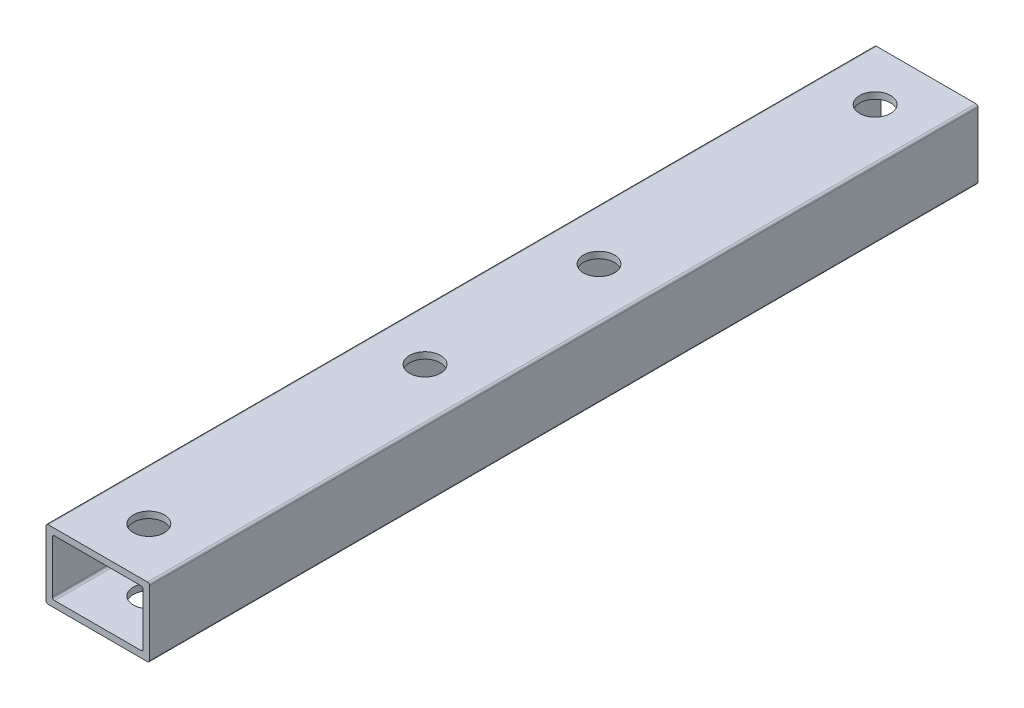
ISO-10303-21;
HEADER;
FILE_DESCRIPTION(('STEP AP214'),'2;1');
FILE_NAME('part.step','',(''),(''),'','','');
FILE_SCHEMA(('AUTOMOTIVE_DESIGN { 1 0 10303 214 1 1 1 1 }'));
ENDSEC;
DATA;
#1=APPLICATION_CONTEXT('core data for automotive mechanical design processes');
#2=APPLICATION_PROTOCOL_DEFINITION('international standard','automotive_design',2000,#1);
#3=PRODUCT_CONTEXT('',#1,'mechanical');
#4=PRODUCT('Part','Part','',(#3));
#5=PRODUCT_RELATED_PRODUCT_CATEGORY('part','',(#4));
#6=PRODUCT_DEFINITION_FORMATION('','',#4);
#7=PRODUCT_DEFINITION_CONTEXT('part definition',#1,'design');
#8=PRODUCT_DEFINITION('design','',#6,#7);
#9=PRODUCT_DEFINITION_SHAPE('','',#8);
#10=(LENGTH_UNIT() NAMED_UNIT(*) SI_UNIT(.MILLI.,.METRE.));
#11=(NAMED_UNIT(*) PLANE_ANGLE_UNIT() SI_UNIT($,.RADIAN.));
#12=(NAMED_UNIT(*) SI_UNIT($,.STERADIAN.) SOLID_ANGLE_UNIT());
#13=UNCERTAINTY_MEASURE_WITH_UNIT(LENGTH_MEASURE(1.E-05),#10,'distance_accuracy_value','');
#14=(GEOMETRIC_REPRESENTATION_CONTEXT(3) GLOBAL_UNCERTAINTY_ASSIGNED_CONTEXT((#13)) GLOBAL_UNIT_ASSIGNED_CONTEXT((#10,
#11,#12)) REPRESENTATION_CONTEXT('',''));
#15=CARTESIAN_POINT('',(0.,0.,0.));
#16=DIRECTION('',(0.,0.,1.));
#17=DIRECTION('',(1.,0.,0.));
#18=AXIS2_PLACEMENT_3D('',#15,#16,#17);
#19=CARTESIAN_POINT('',(-9.14400000000002,-5.969,152.4));
#20=DIRECTION('',(0.,0.,-1.));
#21=DIRECTION('',(-1.,0.,0.));
#22=AXIS2_PLACEMENT_3D('',#19,#20,#21);
#23=CYLINDRICAL_SURFACE('',#22,0.380999999999999);
#24=CARTESIAN_POINT('',(-9.14400000000002,-5.969,152.4));
#25=DIRECTION('',(0.,0.,-1.));
#26=DIRECTION('',(-1.,0.,0.));
#27=AXIS2_PLACEMENT_3D('',#24,#25,#26);
#28=CIRCLE('',#27,0.380999999999999);
#29=CARTESIAN_POINT('',(-9.14400000000002,-6.35000000000001,152.4));
#30=VERTEX_POINT('',#29);
#31=CARTESIAN_POINT('',(-9.52500000000002,-5.969,152.4));
#32=VERTEX_POINT('',#31);
#33=EDGE_CURVE('E131',#30,#32,#28,.T.);
#34=ORIENTED_EDGE('',*,*,#33,.T.);
#35=DIRECTION('',(0.,0.,-1.));
#36=VECTOR('',#35,1.);
#37=CARTESIAN_POINT('',(-9.52500000000002,-5.969,152.4));
#38=LINE('',#37,#36);
#39=CARTESIAN_POINT('',(-9.52500000000002,-5.969,0.));
#40=VERTEX_POINT('',#39);
#41=EDGE_CURVE('E129',#32,#40,#38,.T.);
#42=ORIENTED_EDGE('',*,*,#41,.T.);
#43=CARTESIAN_POINT('',(-9.14400000000002,-5.969,0.));
#44=DIRECTION('',(0.,0.,-1.));
#45=DIRECTION('',(-1.,0.,0.));
#46=AXIS2_PLACEMENT_3D('',#43,#44,#45);
#47=CIRCLE('',#46,0.380999999999999);
#48=CARTESIAN_POINT('',(-9.14400000000002,-6.35000000000001,0.));
#49=VERTEX_POINT('',#48);
#50=EDGE_CURVE('E20',#40,#49,#47,.F.);
#51=ORIENTED_EDGE('',*,*,#50,.T.);
#52=DIRECTION('',(0.,0.,1.));
#53=VECTOR('',#52,1.);
#54=CARTESIAN_POINT('',(-9.14400000000002,-6.35000000000001,152.4));
#55=LINE('',#54,#53);
#56=EDGE_CURVE('E126',#49,#30,#55,.T.);
#57=ORIENTED_EDGE('',*,*,#56,.T.);
#58=EDGE_LOOP('',(#34,#42,#51,#57));
#59=FACE_BOUND('',#58,.T.);
#60=ADVANCED_FACE('F17',(#59),#23,.T.);
#61=CARTESIAN_POINT('',(9.14399999999998,-5.969,152.4));
#62=DIRECTION('',(0.,0.,-1.));
#63=DIRECTION('',(-1.,0.,0.));
#64=AXIS2_PLACEMENT_3D('',#61,#62,#63);
#65=CYLINDRICAL_SURFACE('',#64,0.380999999999999);
#66=CARTESIAN_POINT('',(9.14399999999998,-5.969,152.4));
#67=DIRECTION('',(0.,0.,-1.));
#68=DIRECTION('',(-1.,0.,0.));
#69=AXIS2_PLACEMENT_3D('',#66,#67,#68);
#70=CIRCLE('',#69,0.380999999999999);
#71=CARTESIAN_POINT('',(9.52499999999998,-5.969,152.4));
#72=VERTEX_POINT('',#71);
#73=CARTESIAN_POINT('',(9.14399999999998,-6.35000000000001,152.4));
#74=VERTEX_POINT('',#73);
#75=EDGE_CURVE('E292',#72,#74,#70,.T.);
#76=ORIENTED_EDGE('',*,*,#75,.T.);
#77=DIRECTION('',(0.,0.,1.));
#78=VECTOR('',#77,1.);
#79=CARTESIAN_POINT('',(9.14399999999998,-6.35000000000001,152.4));
#80=LINE('',#79,#78);
#81=CARTESIAN_POINT('',(9.14399999999998,-6.35000000000001,0.));
#82=VERTEX_POINT('',#81);
#83=EDGE_CURVE('E140',#74,#82,#80,.F.);
#84=ORIENTED_EDGE('',*,*,#83,.T.);
#85=CARTESIAN_POINT('',(9.14399999999998,-5.969,0.));
#86=DIRECTION('',(0.,0.,-1.));
#87=DIRECTION('',(-1.,0.,0.));
#88=AXIS2_PLACEMENT_3D('',#85,#86,#87);
#89=CIRCLE('',#88,0.380999999999999);
#90=CARTESIAN_POINT('',(9.52499999999998,-5.969,0.));
#91=VERTEX_POINT('',#90);
#92=EDGE_CURVE('E145',#82,#91,#89,.F.);
#93=ORIENTED_EDGE('',*,*,#92,.T.);
#94=DIRECTION('',(0.,0.,1.));
#95=VECTOR('',#94,1.);
#96=CARTESIAN_POINT('',(9.52499999999998,-5.969,152.4));
#97=LINE('',#96,#95);
#98=EDGE_CURVE('E219',#91,#72,#97,.T.);
#99=ORIENTED_EDGE('',*,*,#98,.T.);
#100=EDGE_LOOP('',(#76,#84,#93,#99));
#101=FACE_BOUND('',#100,.T.);
#102=ADVANCED_FACE('F319',(#101),#65,.T.);
#103=CARTESIAN_POINT('',(0.,-6.35000000000001,143.002));
#104=DIRECTION('',(0.,1.,0.));
#105=DIRECTION('',(0.,0.,1.));
#106=AXIS2_PLACEMENT_3D('',#103,#104,#105);
#107=CYLINDRICAL_SURFACE('',#106,2.85750000000001);
#108=CARTESIAN_POINT('',(0.,-5.1562,143.002));
#109=DIRECTION('',(0.,1.,0.));
#110=DIRECTION('',(0.,0.,1.));
#111=AXIS2_PLACEMENT_3D('',#108,#109,#110);
#112=CIRCLE('',#111,2.85750000000001);
#113=CARTESIAN_POINT('',(0.,-5.1562,145.8595));
#114=VERTEX_POINT('',#113);
#115=EDGE_CURVE('E217',#114,#114,#112,.F.);
#116=ORIENTED_EDGE('',*,*,#115,.F.);
#117=EDGE_LOOP('',(#116));
#118=FACE_BOUND('',#117,.T.);
#119=CARTESIAN_POINT('',(0.,-6.35000000000001,143.002));
#120=DIRECTION('',(0.,1.,0.));
#121=DIRECTION('',(0.,0.,1.));
#122=AXIS2_PLACEMENT_3D('',#119,#120,#121);
#123=CIRCLE('',#122,2.85750000000001);
#124=CARTESIAN_POINT('',(0.,-6.35000000000001,145.8595));
#125=VERTEX_POINT('',#124);
#126=EDGE_CURVE('E222',#125,#125,#123,.F.);
#127=ORIENTED_EDGE('',*,*,#126,.T.);
#128=EDGE_LOOP('',(#127));
#129=FACE_BOUND('',#128,.T.);
#130=ADVANCED_FACE('F321',(#118,#129),#107,.F.);
#131=CARTESIAN_POINT('',(0.,-6.35000000000001,92.202));
#132=DIRECTION('',(0.,1.,0.));
#133=DIRECTION('',(0.,0.,1.));
#134=AXIS2_PLACEMENT_3D('',#131,#132,#133);
#135=CYLINDRICAL_SURFACE('',#134,2.8575);
#136=CARTESIAN_POINT('',(0.,-5.1562,92.202));
#137=DIRECTION('',(0.,1.,0.));
#138=DIRECTION('',(0.,0.,1.));
#139=AXIS2_PLACEMENT_3D('',#136,#137,#138);
#140=CIRCLE('',#139,2.8575);
#141=CARTESIAN_POINT('',(0.,-5.1562,95.0595));
#142=VERTEX_POINT('',#141);
#143=EDGE_CURVE('E262',#142,#142,#140,.F.);
#144=ORIENTED_EDGE('',*,*,#143,.F.);
#145=EDGE_LOOP('',(#144));
#146=FACE_BOUND('',#145,.T.);
#147=CARTESIAN_POINT('',(0.,-6.35000000000001,92.202));
#148=DIRECTION('',(0.,1.,0.));
#149=DIRECTION('',(0.,0.,1.));
#150=AXIS2_PLACEMENT_3D('',#147,#148,#149);
#151=CIRCLE('',#150,2.8575);
#152=CARTESIAN_POINT('',(0.,-6.35000000000001,95.0595));
#153=VERTEX_POINT('',#152);
#154=EDGE_CURVE('E272',#153,#153,#151,.F.);
#155=ORIENTED_EDGE('',*,*,#154,.T.);
#156=EDGE_LOOP('',(#155));
#157=FACE_BOUND('',#156,.T.);
#158=ADVANCED_FACE('F327',(#146,#157),#135,.F.);
#159=CARTESIAN_POINT('',(0.,-6.35000000000001,60.198));
#160=DIRECTION('',(0.,1.,0.));
#161=DIRECTION('',(0.,0.,1.));
#162=AXIS2_PLACEMENT_3D('',#159,#160,#161);
#163=CYLINDRICAL_SURFACE('',#162,2.8575);
#164=CARTESIAN_POINT('',(0.,-5.1562,60.198));
#165=DIRECTION('',(0.,1.,0.));
#166=DIRECTION('',(0.,0.,1.));
#167=AXIS2_PLACEMENT_3D('',#164,#165,#166);
#168=CIRCLE('',#167,2.8575);
#169=CARTESIAN_POINT('',(0.,-5.1562,63.0555));
#170=VERTEX_POINT('',#169);
#171=EDGE_CURVE('E259',#170,#170,#168,.F.);
#172=ORIENTED_EDGE('',*,*,#171,.F.);
#173=EDGE_LOOP('',(#172));
#174=FACE_BOUND('',#173,.T.);
#175=CARTESIAN_POINT('',(0.,-6.35000000000001,60.198));
#176=DIRECTION('',(0.,1.,0.));
#177=DIRECTION('',(0.,0.,1.));
#178=AXIS2_PLACEMENT_3D('',#175,#176,#177);
#179=CIRCLE('',#178,2.8575);
#180=CARTESIAN_POINT('',(0.,-6.35000000000001,63.0555));
#181=VERTEX_POINT('',#180);
#182=EDGE_CURVE('E269',#181,#181,#179,.F.);
#183=ORIENTED_EDGE('',*,*,#182,.T.);
#184=EDGE_LOOP('',(#183));
#185=FACE_BOUND('',#184,.T.);
#186=ADVANCED_FACE('F402',(#174,#185),#163,.F.);
#187=CARTESIAN_POINT('',(0.,-6.35000000000001,9.398));
#188=DIRECTION('',(0.,1.,0.));
#189=DIRECTION('',(0.,0.,1.));
#190=AXIS2_PLACEMENT_3D('',#187,#188,#189);
#191=CYLINDRICAL_SURFACE('',#190,2.8575);
#192=CARTESIAN_POINT('',(0.,-5.1562,9.398));
#193=DIRECTION('',(0.,1.,0.));
#194=DIRECTION('',(0.,0.,1.));
#195=AXIS2_PLACEMENT_3D('',#192,#193,#194);
#196=CIRCLE('',#195,2.8575);
#197=CARTESIAN_POINT('',(0.,-5.1562,12.2555));
#198=VERTEX_POINT('',#197);
#199=EDGE_CURVE('E208',#198,#198,#196,.F.);
#200=ORIENTED_EDGE('',*,*,#199,.F.);
#201=EDGE_LOOP('',(#200));
#202=FACE_BOUND('',#201,.T.);
#203=CARTESIAN_POINT('',(0.,-6.35000000000001,9.398));
#204=DIRECTION('',(0.,1.,0.));
#205=DIRECTION('',(0.,0.,1.));
#206=AXIS2_PLACEMENT_3D('',#203,#204,#205);
#207=CIRCLE('',#206,2.8575);
#208=CARTESIAN_POINT('',(0.,-6.35000000000001,12.2555));
#209=VERTEX_POINT('',#208);
#210=EDGE_CURVE('E141',#209,#209,#207,.F.);
#211=ORIENTED_EDGE('',*,*,#210,.T.);
#212=EDGE_LOOP('',(#211));
#213=FACE_BOUND('',#212,.T.);
#214=ADVANCED_FACE('F398',(#202,#213),#191,.F.);
#215=CARTESIAN_POINT('',(-7.95020000000002,-4.7752,152.4));
#216=DIRECTION('',(0.,0.,-1.));
#217=DIRECTION('',(-1.,0.,0.));
#218=AXIS2_PLACEMENT_3D('',#215,#216,#217);
#219=CYLINDRICAL_SURFACE('',#218,0.380999999999999);
#220=DIRECTION('',(0.,0.,-1.));
#221=VECTOR('',#220,1.);
#222=CARTESIAN_POINT('',(-8.33120000000002,-4.7752,152.4));
#223=LINE('',#222,#221);
#224=CARTESIAN_POINT('',(-8.33120000000002,-4.7752,152.4));
#225=VERTEX_POINT('',#224);
#226=CARTESIAN_POINT('',(-8.33120000000002,-4.7752,0.));
#227=VERTEX_POINT('',#226);
#228=EDGE_CURVE('E214',#225,#227,#223,.T.);
#229=ORIENTED_EDGE('',*,*,#228,.F.);
#230=CARTESIAN_POINT('',(-7.95020000000002,-4.7752,152.4));
#231=DIRECTION('',(0.,0.,-1.));
#232=DIRECTION('',(-1.,0.,0.));
#233=AXIS2_PLACEMENT_3D('',#230,#231,#232);
#234=CIRCLE('',#233,0.380999999999999);
#235=CARTESIAN_POINT('',(-7.95020000000002,-5.1562,152.4));
#236=VERTEX_POINT('',#235);
#237=EDGE_CURVE('E290',#236,#225,#234,.T.);
#238=ORIENTED_EDGE('',*,*,#237,.F.);
#239=DIRECTION('',(0.,0.,1.));
#240=VECTOR('',#239,1.);
#241=CARTESIAN_POINT('',(-7.95020000000002,-5.1562,152.4));
#242=LINE('',#241,#240);
#243=CARTESIAN_POINT('',(-7.95020000000002,-5.1562,0.));
#244=VERTEX_POINT('',#243);
#245=EDGE_CURVE('E205',#244,#236,#242,.T.);
#246=ORIENTED_EDGE('',*,*,#245,.F.);
#247=CARTESIAN_POINT('',(-7.95020000000002,-4.7752,0.));
#248=DIRECTION('',(0.,0.,-1.));
#249=DIRECTION('',(-1.,0.,0.));
#250=AXIS2_PLACEMENT_3D('',#247,#248,#249);
#251=CIRCLE('',#250,0.380999999999999);
#252=EDGE_CURVE('E288',#227,#244,#251,.F.);
#253=ORIENTED_EDGE('',*,*,#252,.F.);
#254=EDGE_LOOP('',(#229,#238,#246,#253));
#255=FACE_BOUND('',#254,.T.);
#256=ADVANCED_FACE('F394',(#255),#219,.F.);
#257=CARTESIAN_POINT('',(7.95019999999998,-4.7752,152.4));
#258=DIRECTION('',(0.,0.,-1.));
#259=DIRECTION('',(-1.,0.,0.));
#260=AXIS2_PLACEMENT_3D('',#257,#258,#259);
#261=CYLINDRICAL_SURFACE('',#260,0.380999999999999);
#262=DIRECTION('',(0.,0.,1.));
#263=VECTOR('',#262,1.);
#264=CARTESIAN_POINT('',(7.95019999999997,-5.1562,152.4));
#265=LINE('',#264,#263);
#266=CARTESIAN_POINT('',(7.95019999999997,-5.1562,152.4));
#267=VERTEX_POINT('',#266);
#268=CARTESIAN_POINT('',(7.95019999999997,-5.1562,0.));
#269=VERTEX_POINT('',#268);
#270=EDGE_CURVE('E202',#267,#269,#265,.F.);
#271=ORIENTED_EDGE('',*,*,#270,.F.);
#272=CARTESIAN_POINT('',(7.95019999999998,-4.7752,152.4));
#273=DIRECTION('',(0.,0.,-1.));
#274=DIRECTION('',(-1.,0.,0.));
#275=AXIS2_PLACEMENT_3D('',#272,#273,#274);
#276=CIRCLE('',#275,0.380999999999999);
#277=CARTESIAN_POINT('',(8.33119999999998,-4.7752,152.4));
#278=VERTEX_POINT('',#277);
#279=EDGE_CURVE('E286',#278,#267,#276,.T.);
#280=ORIENTED_EDGE('',*,*,#279,.F.);
#281=DIRECTION('',(0.,0.,1.));
#282=VECTOR('',#281,1.);
#283=CARTESIAN_POINT('',(8.33119999999998,-4.7752,152.4));
#284=LINE('',#283,#282);
#285=CARTESIAN_POINT('',(8.33119999999998,-4.7752,0.));
#286=VERTEX_POINT('',#285);
#287=EDGE_CURVE('E199',#286,#278,#284,.T.);
#288=ORIENTED_EDGE('',*,*,#287,.F.);
#289=CARTESIAN_POINT('',(7.95019999999998,-4.7752,0.));
#290=DIRECTION('',(0.,0.,-1.));
#291=DIRECTION('',(-1.,0.,0.));
#292=AXIS2_PLACEMENT_3D('',#289,#290,#291);
#293=CIRCLE('',#292,0.380999999999999);
#294=EDGE_CURVE('E284',#269,#286,#293,.F.);
#295=ORIENTED_EDGE('',*,*,#294,.F.);
#296=EDGE_LOOP('',(#271,#280,#288,#295));
#297=FACE_BOUND('',#296,.T.);
#298=ADVANCED_FACE('F390',(#297),#261,.F.);
#299=CARTESIAN_POINT('',(7.95019999999998,4.77519999999999,152.4));
#300=DIRECTION('',(0.,0.,-1.));
#301=DIRECTION('',(-1.,0.,0.));
#302=AXIS2_PLACEMENT_3D('',#299,#300,#301);
#303=CYLINDRICAL_SURFACE('',#302,0.380999999999999);
#304=DIRECTION('',(0.,0.,1.));
#305=VECTOR('',#304,1.);
#306=CARTESIAN_POINT('',(8.33119999999998,4.77519999999999,152.4));
#307=LINE('',#306,#305);
#308=CARTESIAN_POINT('',(8.33119999999998,4.77519999999999,152.4));
#309=VERTEX_POINT('',#308);
#310=CARTESIAN_POINT('',(8.33119999999998,4.77519999999999,0.));
#311=VERTEX_POINT('',#310);
#312=EDGE_CURVE('E195',#309,#311,#307,.F.);
#313=ORIENTED_EDGE('',*,*,#312,.F.);
#314=CARTESIAN_POINT('',(7.95019999999998,4.77519999999999,152.4));
#315=DIRECTION('',(0.,0.,-1.));
#316=DIRECTION('',(-1.,0.,0.));
#317=AXIS2_PLACEMENT_3D('',#314,#315,#316);
#318=CIRCLE('',#317,0.380999999999999);
#319=CARTESIAN_POINT('',(7.95019999999998,5.15619999999999,152.4));
#320=VERTEX_POINT('',#319);
#321=EDGE_CURVE('E282',#320,#309,#318,.T.);
#322=ORIENTED_EDGE('',*,*,#321,.F.);
#323=DIRECTION('',(0.,0.,-1.));
#324=VECTOR('',#323,1.);
#325=CARTESIAN_POINT('',(7.95019999999997,5.15619999999999,152.4));
#326=LINE('',#325,#324);
#327=CARTESIAN_POINT('',(7.95019999999998,5.15619999999999,0.));
#328=VERTEX_POINT('',#327);
#329=EDGE_CURVE('E191',#328,#320,#326,.F.);
#330=ORIENTED_EDGE('',*,*,#329,.F.);
#331=CARTESIAN_POINT('',(7.95019999999998,4.77519999999999,0.));
#332=DIRECTION('',(0.,0.,-1.));
#333=DIRECTION('',(-1.,0.,0.));
#334=AXIS2_PLACEMENT_3D('',#331,#332,#333);
#335=CIRCLE('',#334,0.380999999999999);
#336=EDGE_CURVE('E280',#311,#328,#335,.F.);
#337=ORIENTED_EDGE('',*,*,#336,.F.);
#338=EDGE_LOOP('',(#313,#322,#330,#337));
#339=FACE_BOUND('',#338,.T.);
#340=ADVANCED_FACE('F386',(#339),#303,.F.);
#341=CARTESIAN_POINT('',(-7.95020000000002,4.77519999999999,152.4));
#342=DIRECTION('',(0.,0.,-1.));
#343=DIRECTION('',(-1.,0.,0.));
#344=AXIS2_PLACEMENT_3D('',#341,#342,#343);
#345=CYLINDRICAL_SURFACE('',#344,0.380999999999999);
#346=DIRECTION('',(0.,0.,-1.));
#347=VECTOR('',#346,1.);
#348=CARTESIAN_POINT('',(-7.95020000000002,5.15619999999999,152.4));
#349=LINE('',#348,#347);
#350=CARTESIAN_POINT('',(-7.95020000000002,5.15619999999999,152.4));
#351=VERTEX_POINT('',#350);
#352=CARTESIAN_POINT('',(-7.95020000000002,5.15619999999999,0.));
#353=VERTEX_POINT('',#352);
#354=EDGE_CURVE('E194',#351,#353,#349,.T.);
#355=ORIENTED_EDGE('',*,*,#354,.F.);
#356=CARTESIAN_POINT('',(-7.95020000000002,4.77519999999999,152.4));
#357=DIRECTION('',(0.,0.,-1.));
#358=DIRECTION('',(-1.,0.,0.));
#359=AXIS2_PLACEMENT_3D('',#356,#357,#358);
#360=CIRCLE('',#359,0.380999999999999);
#361=CARTESIAN_POINT('',(-8.33120000000002,4.77519999999999,152.4));
#362=VERTEX_POINT('',#361);
#363=EDGE_CURVE('E278',#362,#351,#360,.T.);
#364=ORIENTED_EDGE('',*,*,#363,.F.);
#365=DIRECTION('',(0.,0.,-1.));
#366=VECTOR('',#365,1.);
#367=CARTESIAN_POINT('',(-8.33120000000002,4.77519999999999,152.4));
#368=LINE('',#367,#366);
#369=CARTESIAN_POINT('',(-8.33120000000002,4.77519999999999,0.));
#370=VERTEX_POINT('',#369);
#371=EDGE_CURVE('E211',#370,#362,#368,.F.);
#372=ORIENTED_EDGE('',*,*,#371,.F.);
#373=CARTESIAN_POINT('',(-7.95020000000002,4.77519999999999,0.));
#374=DIRECTION('',(0.,0.,-1.));
#375=DIRECTION('',(-1.,0.,0.));
#376=AXIS2_PLACEMENT_3D('',#373,#374,#375);
#377=CIRCLE('',#376,0.380999999999999);
#378=EDGE_CURVE('E228',#353,#370,#377,.F.);
#379=ORIENTED_EDGE('',*,*,#378,.F.);
#380=EDGE_LOOP('',(#355,#364,#372,#379));
#381=FACE_BOUND('',#380,.T.);
#382=ADVANCED_FACE('F383',(#381),#345,.F.);
#383=CARTESIAN_POINT('',(-9.52500000000002,-5.969,152.4));
#384=DIRECTION('',(1.,0.,0.));
#385=DIRECTION('',(0.,0.,-1.));
#386=AXIS2_PLACEMENT_3D('',#383,#384,#385);
#387=PLANE('',#386);
#388=ORIENTED_EDGE('',*,*,#41,.F.);
#389=DIRECTION('',(0.,1.,0.));
#390=VECTOR('',#389,1.);
#391=CARTESIAN_POINT('',(-9.52500000000002,-5.969,152.4));
#392=LINE('',#391,#390);
#393=CARTESIAN_POINT('',(-9.52500000000002,5.96899999999999,152.4));
#394=VERTEX_POINT('',#393);
#395=EDGE_CURVE('E187',#32,#394,#392,.T.);
#396=ORIENTED_EDGE('',*,*,#395,.T.);
#397=DIRECTION('',(0.,0.,-1.));
#398=VECTOR('',#397,1.);
#399=CARTESIAN_POINT('',(-9.52500000000002,5.96899999999999,152.4));
#400=LINE('',#399,#398);
#401=CARTESIAN_POINT('',(-9.52500000000002,5.96899999999999,0.));
#402=VERTEX_POINT('',#401);
#403=EDGE_CURVE('E172',#402,#394,#400,.F.);
#404=ORIENTED_EDGE('',*,*,#403,.F.);
#405=DIRECTION('',(0.,1.,0.));
#406=VECTOR('',#405,1.);
#407=CARTESIAN_POINT('',(-9.52500000000002,-5.969,0.));
#408=LINE('',#407,#406);
#409=EDGE_CURVE('E157',#40,#402,#408,.T.);
#410=ORIENTED_EDGE('',*,*,#409,.F.);
#411=EDGE_LOOP('',(#388,#396,#404,#410));
#412=FACE_BOUND('',#411,.T.);
#413=ADVANCED_FACE('F297',(#412),#387,.F.);
#414=CARTESIAN_POINT('',(9.52499999999998,-5.969,152.4));
#415=DIRECTION('',(-1.,0.,0.));
#416=DIRECTION('',(0.,0.,1.));
#417=AXIS2_PLACEMENT_3D('',#414,#415,#416);
#418=PLANE('',#417);
#419=DIRECTION('',(0.,0.,-1.));
#420=VECTOR('',#419,1.);
#421=CARTESIAN_POINT('',(9.52499999999998,5.96899999999999,152.4));
#422=LINE('',#421,#420);
#423=CARTESIAN_POINT('',(9.52499999999998,5.96899999999999,152.4));
#424=VERTEX_POINT('',#423);
#425=CARTESIAN_POINT('',(9.52499999999998,5.96899999999999,0.));
#426=VERTEX_POINT('',#425);
#427=EDGE_CURVE('E190',#424,#426,#422,.T.);
#428=ORIENTED_EDGE('',*,*,#427,.F.);
#429=DIRECTION('',(0.,1.,0.));
#430=VECTOR('',#429,1.);
#431=CARTESIAN_POINT('',(9.52499999999998,-5.969,152.4));
#432=LINE('',#431,#430);
#433=EDGE_CURVE('E183',#424,#72,#432,.F.);
#434=ORIENTED_EDGE('',*,*,#433,.T.);
#435=ORIENTED_EDGE('',*,*,#98,.F.);
#436=DIRECTION('',(0.,1.,0.));
#437=VECTOR('',#436,1.);
#438=CARTESIAN_POINT('',(9.52499999999998,-5.969,0.));
#439=LINE('',#438,#437);
#440=EDGE_CURVE('E148',#426,#91,#439,.F.);
#441=ORIENTED_EDGE('',*,*,#440,.F.);
#442=EDGE_LOOP('',(#428,#434,#435,#441));
#443=FACE_BOUND('',#442,.T.);
#444=ADVANCED_FACE('F316',(#443),#418,.F.);
#445=CARTESIAN_POINT('',(-9.14400000000002,-6.35000000000001,152.4));
#446=DIRECTION('',(0.,1.,0.));
#447=DIRECTION('',(0.,0.,1.));
#448=AXIS2_PLACEMENT_3D('',#445,#446,#447);
#449=PLANE('',#448);
#450=ORIENTED_EDGE('',*,*,#83,.F.);
#451=DIRECTION('',(-1.,0.,0.));
#452=VECTOR('',#451,1.);
#453=CARTESIAN_POINT('',(-9.14400000000002,-6.35000000000001,152.4));
#454=LINE('',#453,#452);
#455=EDGE_CURVE('E139',#74,#30,#454,.T.);
#456=ORIENTED_EDGE('',*,*,#455,.T.);
#457=ORIENTED_EDGE('',*,*,#56,.F.);
#458=DIRECTION('',(-1.,0.,0.));
#459=VECTOR('',#458,1.);
#460=CARTESIAN_POINT('',(-9.14400000000002,-6.35000000000001,0.));
#461=LINE('',#460,#459);
#462=EDGE_CURVE('E137',#82,#49,#461,.T.);
#463=ORIENTED_EDGE('',*,*,#462,.F.);
#464=EDGE_LOOP('',(#450,#456,#457,#463));
#465=FACE_BOUND('',#464,.T.);
#466=ORIENTED_EDGE('',*,*,#210,.F.);
#467=EDGE_LOOP('',(#466));
#468=FACE_BOUND('',#467,.T.);
#469=ORIENTED_EDGE('',*,*,#182,.F.);
#470=EDGE_LOOP('',(#469));
#471=FACE_BOUND('',#470,.T.);
#472=ORIENTED_EDGE('',*,*,#154,.F.);
#473=EDGE_LOOP('',(#472));
#474=FACE_BOUND('',#473,.T.);
#475=ORIENTED_EDGE('',*,*,#126,.F.);
#476=EDGE_LOOP('',(#475));
#477=FACE_BOUND('',#476,.T.);
#478=ADVANCED_FACE('F135',(#465,#468,#471,#474,#477),#449,.F.);
#479=CARTESIAN_POINT('',(-8.33120000000002,-4.7752,152.4));
#480=DIRECTION('',(1.,0.,0.));
#481=DIRECTION('',(0.,0.,-1.));
#482=AXIS2_PLACEMENT_3D('',#479,#480,#481);
#483=PLANE('',#482);
#484=DIRECTION('',(0.,1.,0.));
#485=VECTOR('',#484,1.);
#486=CARTESIAN_POINT('',(-8.33120000000002,-5.969,152.4));
#487=LINE('',#486,#485);
#488=EDGE_CURVE('E169',#362,#225,#487,.F.);
#489=ORIENTED_EDGE('',*,*,#488,.T.);
#490=ORIENTED_EDGE('',*,*,#228,.T.);
#491=DIRECTION('',(0.,1.,0.));
#492=VECTOR('',#491,1.);
#493=CARTESIAN_POINT('',(-8.33120000000002,-5.969,0.));
#494=LINE('',#493,#492);
#495=EDGE_CURVE('E147',#370,#227,#494,.F.);
#496=ORIENTED_EDGE('',*,*,#495,.F.);
#497=ORIENTED_EDGE('',*,*,#371,.T.);
#498=EDGE_LOOP('',(#489,#490,#496,#497));
#499=FACE_BOUND('',#498,.T.);
#500=ADVANCED_FACE('F372',(#499),#483,.T.);
#501=CARTESIAN_POINT('',(-7.95020000000002,-5.1562,152.4));
#502=DIRECTION('',(0.,1.,0.));
#503=DIRECTION('',(0.,0.,1.));
#504=AXIS2_PLACEMENT_3D('',#501,#502,#503);
#505=PLANE('',#504);
#506=DIRECTION('',(-1.,0.,0.));
#507=VECTOR('',#506,1.);
#508=CARTESIAN_POINT('',(-9.14400000000002,-5.1562,152.4));
#509=LINE('',#508,#507);
#510=EDGE_CURVE('E179',#236,#267,#509,.F.);
#511=ORIENTED_EDGE('',*,*,#510,.T.);
#512=ORIENTED_EDGE('',*,*,#270,.T.);
#513=DIRECTION('',(-1.,0.,0.));
#514=VECTOR('',#513,1.);
#515=CARTESIAN_POINT('',(-9.14400000000002,-5.1562,0.));
#516=LINE('',#515,#514);
#517=EDGE_CURVE('E151',#244,#269,#516,.F.);
#518=ORIENTED_EDGE('',*,*,#517,.F.);
#519=ORIENTED_EDGE('',*,*,#245,.T.);
#520=EDGE_LOOP('',(#511,#512,#518,#519));
#521=FACE_BOUND('',#520,.T.);
#522=ORIENTED_EDGE('',*,*,#199,.T.);
#523=EDGE_LOOP('',(#522));
#524=FACE_BOUND('',#523,.T.);
#525=ORIENTED_EDGE('',*,*,#171,.T.);
#526=EDGE_LOOP('',(#525));
#527=FACE_BOUND('',#526,.T.);
#528=ORIENTED_EDGE('',*,*,#143,.T.);
#529=EDGE_LOOP('',(#528));
#530=FACE_BOUND('',#529,.T.);
#531=ORIENTED_EDGE('',*,*,#115,.T.);
#532=EDGE_LOOP('',(#531));
#533=FACE_BOUND('',#532,.T.);
#534=ADVANCED_FACE('F368',(#521,#524,#527,#530,#533),#505,.T.);
#535=CARTESIAN_POINT('',(8.33119999999998,-4.7752,152.4));
#536=DIRECTION('',(-1.,0.,0.));
#537=DIRECTION('',(0.,-1.,0.));
#538=AXIS2_PLACEMENT_3D('',#535,#536,#537);
#539=PLANE('',#538);
#540=DIRECTION('',(0.,1.,0.));
#541=VECTOR('',#540,1.);
#542=CARTESIAN_POINT('',(8.33119999999998,-5.969,152.4));
#543=LINE('',#542,#541);
#544=EDGE_CURVE('E176',#278,#309,#543,.T.);
#545=ORIENTED_EDGE('',*,*,#544,.T.);
#546=ORIENTED_EDGE('',*,*,#312,.T.);
#547=DIRECTION('',(0.,1.,0.));
#548=VECTOR('',#547,1.);
#549=CARTESIAN_POINT('',(8.33119999999998,-5.969,0.));
#550=LINE('',#549,#548);
#551=EDGE_CURVE('E599',#286,#311,#550,.T.);
#552=ORIENTED_EDGE('',*,*,#551,.F.);
#553=ORIENTED_EDGE('',*,*,#287,.T.);
#554=EDGE_LOOP('',(#545,#546,#552,#553));
#555=FACE_BOUND('',#554,.T.);
#556=ADVANCED_FACE('F364',(#555),#539,.T.);
#557=CARTESIAN_POINT('',(-7.95020000000002,5.15619999999999,152.4));
#558=DIRECTION('',(0.,-1.,0.));
#559=DIRECTION('',(0.,0.,-1.));
#560=AXIS2_PLACEMENT_3D('',#557,#558,#559);
#561=PLANE('',#560);
#562=DIRECTION('',(-1.,0.,0.));
#563=VECTOR('',#562,1.);
#564=CARTESIAN_POINT('',(-9.14400000000002,5.15619999999999,152.4));
#565=LINE('',#564,#563);
#566=EDGE_CURVE('E173',#320,#351,#565,.T.);
#567=ORIENTED_EDGE('',*,*,#566,.T.);
#568=ORIENTED_EDGE('',*,*,#354,.T.);
#569=DIRECTION('',(-1.,0.,0.));
#570=VECTOR('',#569,1.);
#571=CARTESIAN_POINT('',(-9.14400000000002,5.15619999999999,0.));
#572=LINE('',#571,#570);
#573=EDGE_CURVE('E240',#328,#353,#572,.T.);
#574=ORIENTED_EDGE('',*,*,#573,.F.);
#575=ORIENTED_EDGE('',*,*,#329,.T.);
#576=EDGE_LOOP('',(#567,#568,#574,#575));
#577=FACE_BOUND('',#576,.T.);
#578=CARTESIAN_POINT('',(0.,5.1562,9.398));
#579=DIRECTION('',(0.,1.,0.));
#580=DIRECTION('',(0.,0.,1.));
#581=AXIS2_PLACEMENT_3D('',#578,#579,#580);
#582=CIRCLE('',#581,2.8575);
#583=CARTESIAN_POINT('',(0.,5.1562,12.2555));
#584=VERTEX_POINT('',#583);
#585=EDGE_CURVE('E225',#584,#584,#582,.T.);
#586=ORIENTED_EDGE('',*,*,#585,.T.);
#587=EDGE_LOOP('',(#586));
#588=FACE_BOUND('',#587,.T.);
#589=CARTESIAN_POINT('',(0.,5.1562,60.198));
#590=DIRECTION('',(0.,1.,0.));
#591=DIRECTION('',(0.,0.,1.));
#592=AXIS2_PLACEMENT_3D('',#589,#590,#591);
#593=CIRCLE('',#592,2.8575);
#594=CARTESIAN_POINT('',(0.,5.1562,63.0555));
#595=VERTEX_POINT('',#594);
#596=EDGE_CURVE('E249',#595,#595,#593,.T.);
#597=ORIENTED_EDGE('',*,*,#596,.T.);
#598=EDGE_LOOP('',(#597));
#599=FACE_BOUND('',#598,.T.);
#600=CARTESIAN_POINT('',(0.,5.1562,92.202));
#601=DIRECTION('',(0.,1.,0.));
#602=DIRECTION('',(0.,0.,1.));
#603=AXIS2_PLACEMENT_3D('',#600,#601,#602);
#604=CIRCLE('',#603,2.8575);
#605=CARTESIAN_POINT('',(0.,5.1562,95.0595));
#606=VERTEX_POINT('',#605);
#607=EDGE_CURVE('E252',#606,#606,#604,.T.);
#608=ORIENTED_EDGE('',*,*,#607,.T.);
#609=EDGE_LOOP('',(#608));
#610=FACE_BOUND('',#609,.T.);
#611=CARTESIAN_POINT('',(0.,5.1562,143.002));
#612=DIRECTION('',(0.,1.,0.));
#613=DIRECTION('',(0.,0.,1.));
#614=AXIS2_PLACEMENT_3D('',#611,#612,#613);
#615=CIRCLE('',#614,2.85750000000001);
#616=CARTESIAN_POINT('',(0.,5.1562,145.8595));
#617=VERTEX_POINT('',#616);
#618=EDGE_CURVE('E198',#617,#617,#615,.T.);
#619=ORIENTED_EDGE('',*,*,#618,.T.);
#620=EDGE_LOOP('',(#619));
#621=FACE_BOUND('',#620,.T.);
#622=ADVANCED_FACE('F360',(#577,#588,#599,#610,#621),#561,.T.);
#623=CARTESIAN_POINT('',(0.,-6.35000000000001,143.002));
#624=DIRECTION('',(0.,1.,0.));
#625=DIRECTION('',(0.,0.,1.));
#626=AXIS2_PLACEMENT_3D('',#623,#624,#625);
#627=CYLINDRICAL_SURFACE('',#626,2.85750000000001);
#628=ORIENTED_EDGE('',*,*,#618,.F.);
#629=EDGE_LOOP('',(#628));
#630=FACE_BOUND('',#629,.T.);
#631=CARTESIAN_POINT('',(0.,6.34999999999999,143.002));
#632=DIRECTION('',(0.,1.,0.));
#633=DIRECTION('',(0.,0.,1.));
#634=AXIS2_PLACEMENT_3D('',#631,#632,#633);
#635=CIRCLE('',#634,2.85750000000001);
#636=CARTESIAN_POINT('',(0.,6.34999999999999,145.8595));
#637=VERTEX_POINT('',#636);
#638=EDGE_CURVE('E237',#637,#637,#635,.T.);
#639=ORIENTED_EDGE('',*,*,#638,.T.);
#640=EDGE_LOOP('',(#639));
#641=FACE_BOUND('',#640,.T.);
#642=ADVANCED_FACE('F356',(#630,#641),#627,.F.);
#643=CARTESIAN_POINT('',(0.,-6.35000000000001,92.202));
#644=DIRECTION('',(0.,1.,0.));
#645=DIRECTION('',(0.,0.,1.));
#646=AXIS2_PLACEMENT_3D('',#643,#644,#645);
#647=CYLINDRICAL_SURFACE('',#646,2.8575);
#648=ORIENTED_EDGE('',*,*,#607,.F.);
#649=EDGE_LOOP('',(#648));
#650=FACE_BOUND('',#649,.T.);
#651=CARTESIAN_POINT('',(0.,6.34999999999999,92.202));
#652=DIRECTION('',(0.,1.,0.));
#653=DIRECTION('',(0.,0.,1.));
#654=AXIS2_PLACEMENT_3D('',#651,#652,#653);
#655=CIRCLE('',#654,2.8575);
#656=CARTESIAN_POINT('',(0.,6.34999999999999,95.0595));
#657=VERTEX_POINT('',#656);
#658=EDGE_CURVE('E234',#657,#657,#655,.T.);
#659=ORIENTED_EDGE('',*,*,#658,.T.);
#660=EDGE_LOOP('',(#659));
#661=FACE_BOUND('',#660,.T.);
#662=ADVANCED_FACE('F352',(#650,#661),#647,.F.);
#663=CARTESIAN_POINT('',(0.,-6.35000000000001,60.198));
#664=DIRECTION('',(0.,1.,0.));
#665=DIRECTION('',(0.,0.,1.));
#666=AXIS2_PLACEMENT_3D('',#663,#664,#665);
#667=CYLINDRICAL_SURFACE('',#666,2.8575);
#668=ORIENTED_EDGE('',*,*,#596,.F.);
#669=EDGE_LOOP('',(#668));
#670=FACE_BOUND('',#669,.T.);
#671=CARTESIAN_POINT('',(0.,6.34999999999999,60.198));
#672=DIRECTION('',(0.,1.,0.));
#673=DIRECTION('',(0.,0.,1.));
#674=AXIS2_PLACEMENT_3D('',#671,#672,#673);
#675=CIRCLE('',#674,2.8575);
#676=CARTESIAN_POINT('',(0.,6.34999999999999,63.0555));
#677=VERTEX_POINT('',#676);
#678=EDGE_CURVE('E231',#677,#677,#675,.T.);
#679=ORIENTED_EDGE('',*,*,#678,.T.);
#680=EDGE_LOOP('',(#679));
#681=FACE_BOUND('',#680,.T.);
#682=ADVANCED_FACE('F348',(#670,#681),#667,.F.);
#683=CARTESIAN_POINT('',(0.,-6.35000000000001,9.398));
#684=DIRECTION('',(0.,1.,0.));
#685=DIRECTION('',(0.,0.,1.));
#686=AXIS2_PLACEMENT_3D('',#683,#684,#685);
#687=CYLINDRICAL_SURFACE('',#686,2.8575);
#688=ORIENTED_EDGE('',*,*,#585,.F.);
#689=EDGE_LOOP('',(#688));
#690=FACE_BOUND('',#689,.T.);
#691=CARTESIAN_POINT('',(0.,6.34999999999999,9.398));
#692=DIRECTION('',(0.,1.,0.));
#693=DIRECTION('',(0.,0.,1.));
#694=AXIS2_PLACEMENT_3D('',#691,#692,#693);
#695=CIRCLE('',#694,2.8575);
#696=CARTESIAN_POINT('',(0.,6.34999999999999,12.2555));
#697=VERTEX_POINT('',#696);
#698=EDGE_CURVE('E166',#697,#697,#695,.T.);
#699=ORIENTED_EDGE('',*,*,#698,.T.);
#700=EDGE_LOOP('',(#699));
#701=FACE_BOUND('',#700,.T.);
#702=ADVANCED_FACE('F345',(#690,#701),#687,.F.);
#703=CARTESIAN_POINT('',(9.14399999999998,5.96899999999999,152.4));
#704=DIRECTION('',(0.,0.,-1.));
#705=DIRECTION('',(-1.,0.,0.));
#706=AXIS2_PLACEMENT_3D('',#703,#704,#705);
#707=CYLINDRICAL_SURFACE('',#706,0.380999999999999);
#708=CARTESIAN_POINT('',(9.14399999999998,5.96899999999999,152.4));
#709=DIRECTION('',(0.,0.,-1.));
#710=DIRECTION('',(-1.,0.,0.));
#711=AXIS2_PLACEMENT_3D('',#708,#709,#710);
#712=CIRCLE('',#711,0.380999999999999);
#713=CARTESIAN_POINT('',(9.14399999999998,6.34999999999999,152.4));
#714=VERTEX_POINT('',#713);
#715=EDGE_CURVE('E186',#714,#424,#712,.T.);
#716=ORIENTED_EDGE('',*,*,#715,.T.);
#717=ORIENTED_EDGE('',*,*,#427,.T.);
#718=CARTESIAN_POINT('',(9.14399999999998,5.96899999999999,0.));
#719=DIRECTION('',(0.,0.,-1.));
#720=DIRECTION('',(-1.,0.,0.));
#721=AXIS2_PLACEMENT_3D('',#718,#719,#720);
#722=CIRCLE('',#721,0.380999999999999);
#723=CARTESIAN_POINT('',(9.14399999999998,6.34999999999999,0.));
#724=VERTEX_POINT('',#723);
#725=EDGE_CURVE('E153',#724,#426,#722,.T.);
#726=ORIENTED_EDGE('',*,*,#725,.F.);
#727=DIRECTION('',(0.,0.,-1.));
#728=VECTOR('',#727,1.);
#729=CARTESIAN_POINT('',(9.14399999999998,6.34999999999999,152.4));
#730=LINE('',#729,#728);
#731=EDGE_CURVE('E163',#724,#714,#730,.F.);
#732=ORIENTED_EDGE('',*,*,#731,.T.);
#733=EDGE_LOOP('',(#716,#717,#726,#732));
#734=FACE_BOUND('',#733,.T.);
#735=ADVANCED_FACE('F313',(#734),#707,.T.);
#736=CARTESIAN_POINT('',(-9.14400000000002,-5.969,152.4));
#737=DIRECTION('',(0.,0.,-1.));
#738=DIRECTION('',(-1.,0.,0.));
#739=AXIS2_PLACEMENT_3D('',#736,#737,#738);
#740=PLANE('',#739);
#741=ORIENTED_EDGE('',*,*,#488,.F.);
#742=ORIENTED_EDGE('',*,*,#363,.T.);
#743=ORIENTED_EDGE('',*,*,#566,.F.);
#744=ORIENTED_EDGE('',*,*,#321,.T.);
#745=ORIENTED_EDGE('',*,*,#544,.F.);
#746=ORIENTED_EDGE('',*,*,#279,.T.);
#747=ORIENTED_EDGE('',*,*,#510,.F.);
#748=ORIENTED_EDGE('',*,*,#237,.T.);
#749=EDGE_LOOP('',(#741,#742,#743,#744,#745,#746,#747,#748));
#750=FACE_BOUND('',#749,.T.);
#751=ORIENTED_EDGE('',*,*,#455,.F.);
#752=ORIENTED_EDGE('',*,*,#75,.F.);
#753=ORIENTED_EDGE('',*,*,#433,.F.);
#754=ORIENTED_EDGE('',*,*,#715,.F.);
#755=DIRECTION('',(1.,0.,0.));
#756=VECTOR('',#755,1.);
#757=CARTESIAN_POINT('',(-9.14400000000002,6.34999999999999,152.4));
#758=LINE('',#757,#756);
#759=CARTESIAN_POINT('',(-9.14400000000002,6.34999999999999,152.4));
#760=VERTEX_POINT('',#759);
#761=EDGE_CURVE('E161',#714,#760,#758,.F.);
#762=ORIENTED_EDGE('',*,*,#761,.T.);
#763=CARTESIAN_POINT('',(-9.14400000000002,5.96899999999999,152.4));
#764=DIRECTION('',(0.,0.,-1.));
#765=DIRECTION('',(-1.,0.,0.));
#766=AXIS2_PLACEMENT_3D('',#763,#764,#765);
#767=CIRCLE('',#766,0.380999999999999);
#768=EDGE_CURVE('E159',#394,#760,#767,.T.);
#769=ORIENTED_EDGE('',*,*,#768,.F.);
#770=ORIENTED_EDGE('',*,*,#395,.F.);
#771=ORIENTED_EDGE('',*,*,#33,.F.);
#772=EDGE_LOOP('',(#751,#752,#753,#754,#762,#769,#770,#771));
#773=FACE_BOUND('',#772,.T.);
#774=ADVANCED_FACE('F300',(#750,#773),#740,.F.);
#775=CARTESIAN_POINT('',(-9.14400000000002,5.96899999999999,152.4));
#776=DIRECTION('',(0.,0.,-1.));
#777=DIRECTION('',(-1.,0.,0.));
#778=AXIS2_PLACEMENT_3D('',#775,#776,#777);
#779=CYLINDRICAL_SURFACE('',#778,0.380999999999999);
#780=ORIENTED_EDGE('',*,*,#768,.T.);
#781=DIRECTION('',(0.,0.,-1.));
#782=VECTOR('',#781,1.);
#783=CARTESIAN_POINT('',(-9.14400000000002,6.34999999999999,152.4));
#784=LINE('',#783,#782);
#785=CARTESIAN_POINT('',(-9.14400000000002,6.34999999999999,0.));
#786=VERTEX_POINT('',#785);
#787=EDGE_CURVE('E26',#760,#786,#784,.T.);
#788=ORIENTED_EDGE('',*,*,#787,.T.);
#789=CARTESIAN_POINT('',(-9.14400000000002,5.96899999999999,0.));
#790=DIRECTION('',(0.,0.,-1.));
#791=DIRECTION('',(-1.,0.,0.));
#792=AXIS2_PLACEMENT_3D('',#789,#790,#791);
#793=CIRCLE('',#792,0.380999999999999);
#794=EDGE_CURVE('E34',#402,#786,#793,.T.);
#795=ORIENTED_EDGE('',*,*,#794,.F.);
#796=ORIENTED_EDGE('',*,*,#403,.T.);
#797=EDGE_LOOP('',(#780,#788,#795,#796));
#798=FACE_BOUND('',#797,.T.);
#799=ADVANCED_FACE('F304',(#798),#779,.T.);
#800=CARTESIAN_POINT('',(-9.14400000000002,-5.969,0.));
#801=DIRECTION('',(0.,0.,-1.));
#802=DIRECTION('',(-1.,0.,0.));
#803=AXIS2_PLACEMENT_3D('',#800,#801,#802);
#804=PLANE('',#803);
#805=ORIENTED_EDGE('',*,*,#573,.T.);
#806=ORIENTED_EDGE('',*,*,#378,.T.);
#807=ORIENTED_EDGE('',*,*,#495,.T.);
#808=ORIENTED_EDGE('',*,*,#252,.T.);
#809=ORIENTED_EDGE('',*,*,#517,.T.);
#810=ORIENTED_EDGE('',*,*,#294,.T.);
#811=ORIENTED_EDGE('',*,*,#551,.T.);
#812=ORIENTED_EDGE('',*,*,#336,.T.);
#813=EDGE_LOOP('',(#805,#806,#807,#808,#809,#810,#811,#812));
#814=FACE_BOUND('',#813,.T.);
#815=ORIENTED_EDGE('',*,*,#92,.F.);
#816=ORIENTED_EDGE('',*,*,#462,.T.);
#817=ORIENTED_EDGE('',*,*,#50,.F.);
#818=ORIENTED_EDGE('',*,*,#409,.T.);
#819=ORIENTED_EDGE('',*,*,#794,.T.);
#820=DIRECTION('',(1.,0.,0.));
#821=VECTOR('',#820,1.);
#822=CARTESIAN_POINT('',(-9.14400000000002,6.34999999999999,0.));
#823=LINE('',#822,#821);
#824=EDGE_CURVE('E11',#786,#724,#823,.T.);
#825=ORIENTED_EDGE('',*,*,#824,.T.);
#826=ORIENTED_EDGE('',*,*,#725,.T.);
#827=ORIENTED_EDGE('',*,*,#440,.T.);
#828=EDGE_LOOP('',(#815,#816,#817,#818,#819,#825,#826,#827));
#829=FACE_BOUND('',#828,.T.);
#830=ADVANCED_FACE('F143',(#814,#829),#804,.T.);
#831=CARTESIAN_POINT('',(-9.14400000000002,6.34999999999999,152.4));
#832=DIRECTION('',(0.,-1.,0.));
#833=DIRECTION('',(0.,0.,-1.));
#834=AXIS2_PLACEMENT_3D('',#831,#832,#833);
#835=PLANE('',#834);
#836=ORIENTED_EDGE('',*,*,#787,.F.);
#837=ORIENTED_EDGE('',*,*,#761,.F.);
#838=ORIENTED_EDGE('',*,*,#731,.F.);
#839=ORIENTED_EDGE('',*,*,#824,.F.);
#840=EDGE_LOOP('',(#836,#837,#838,#839));
#841=FACE_BOUND('',#840,.T.);
#842=ORIENTED_EDGE('',*,*,#698,.F.);
#843=EDGE_LOOP('',(#842));
#844=FACE_BOUND('',#843,.T.);
#845=ORIENTED_EDGE('',*,*,#678,.F.);
#846=EDGE_LOOP('',(#845));
#847=FACE_BOUND('',#846,.T.);
#848=ORIENTED_EDGE('',*,*,#658,.F.);
#849=EDGE_LOOP('',(#848));
#850=FACE_BOUND('',#849,.T.);
#851=ORIENTED_EDGE('',*,*,#638,.F.);
#852=EDGE_LOOP('',(#851));
#853=FACE_BOUND('',#852,.T.);
#854=ADVANCED_FACE('F306',(#841,#844,#847,#850,#853),#835,.F.);
#855=CLOSED_SHELL('',(#60,#102,#130,#158,#186,#214,#256,#298,#340,#382,#413,#444,#478,#500,#534,
#556,#622,#642,#662,#682,#702,#735,#774,#799,#830,#854));
#856=MANIFOLD_SOLID_BREP('B1',#855);
#857=ADVANCED_BREP_SHAPE_REPRESENTATION('',(#18,#856),#14);
#858=SHAPE_DEFINITION_REPRESENTATION(#9,#857);
ENDSEC;
END-ISO-10303-21;
